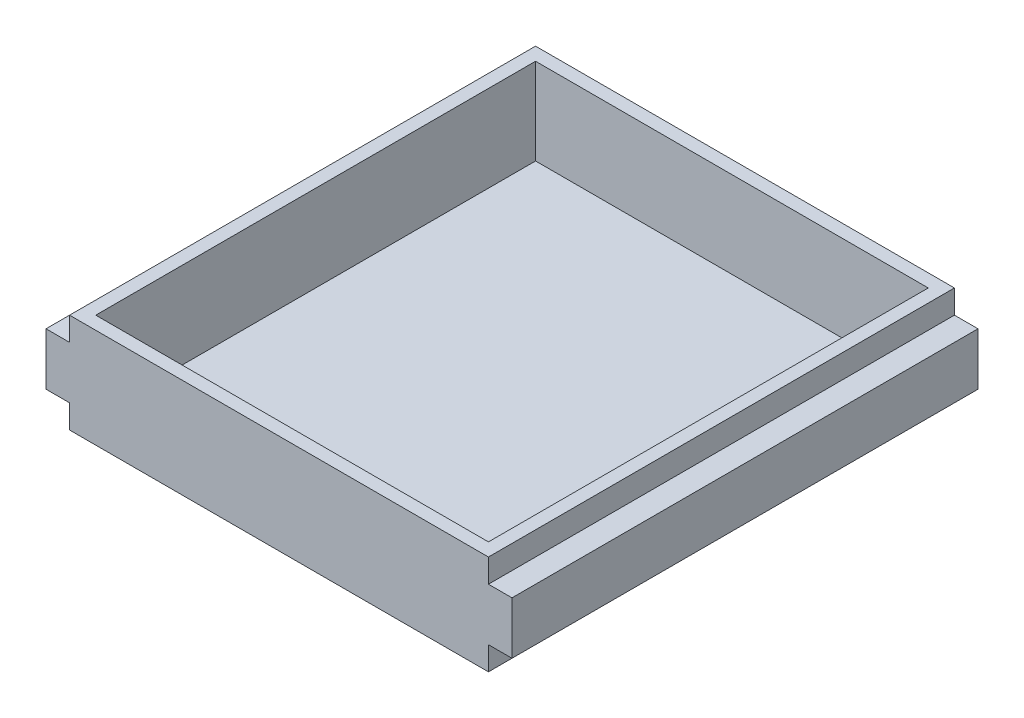
ISO-10303-21;
HEADER;
FILE_DESCRIPTION(('STEP AP214'),'2;1');
FILE_NAME('part.step','',(''),(''),'','','');
FILE_SCHEMA(('AUTOMOTIVE_DESIGN { 1 0 10303 214 1 1 1 1 }'));
ENDSEC;
DATA;
#1=APPLICATION_CONTEXT('core data for automotive mechanical design processes');
#2=APPLICATION_PROTOCOL_DEFINITION('international standard','automotive_design',2000,#1);
#3=PRODUCT_CONTEXT('',#1,'mechanical');
#4=PRODUCT('Part','Part','',(#3));
#5=PRODUCT_RELATED_PRODUCT_CATEGORY('part','',(#4));
#6=PRODUCT_DEFINITION_FORMATION('','',#4);
#7=PRODUCT_DEFINITION_CONTEXT('part definition',#1,'design');
#8=PRODUCT_DEFINITION('design','',#6,#7);
#9=PRODUCT_DEFINITION_SHAPE('','',#8);
#10=(LENGTH_UNIT() NAMED_UNIT(*) SI_UNIT(.MILLI.,.METRE.));
#11=(NAMED_UNIT(*) PLANE_ANGLE_UNIT() SI_UNIT($,.RADIAN.));
#12=(NAMED_UNIT(*) SI_UNIT($,.STERADIAN.) SOLID_ANGLE_UNIT());
#13=UNCERTAINTY_MEASURE_WITH_UNIT(LENGTH_MEASURE(1.E-05),#10,'distance_accuracy_value','');
#14=(GEOMETRIC_REPRESENTATION_CONTEXT(3) GLOBAL_UNCERTAINTY_ASSIGNED_CONTEXT((#13)) GLOBAL_UNIT_ASSIGNED_CONTEXT((#10,
#11,#12)) REPRESENTATION_CONTEXT('',''));
#15=CARTESIAN_POINT('',(0.,0.,0.));
#16=DIRECTION('',(0.,0.,1.));
#17=DIRECTION('',(1.,0.,0.));
#18=AXIS2_PLACEMENT_3D('',#15,#16,#17);
#19=CARTESIAN_POINT('',(169.,0.,-178.));
#20=DIRECTION('',(0.,-1.,0.));
#21=DIRECTION('',(1.,0.,0.));
#22=AXIS2_PLACEMENT_3D('',#19,#20,#21);
#23=PLANE('',#22);
#24=DIRECTION('',(1.,0.,0.));
#25=VECTOR('',#24,1.);
#26=CARTESIAN_POINT('',(169.,0.,0.));
#27=LINE('',#26,#25);
#28=CARTESIAN_POINT('',(169.,0.,0.));
#29=VERTEX_POINT('',#28);
#30=CARTESIAN_POINT('',(178.,0.,0.));
#31=VERTEX_POINT('',#30);
#32=EDGE_CURVE('E167',#29,#31,#27,.T.);
#33=ORIENTED_EDGE('',*,*,#32,.F.);
#34=DIRECTION('',(0.,0.,1.));
#35=VECTOR('',#34,1.);
#36=CARTESIAN_POINT('',(169.,0.,-178.));
#37=LINE('',#36,#35);
#38=CARTESIAN_POINT('',(169.,0.,-178.));
#39=VERTEX_POINT('',#38);
#40=EDGE_CURVE('E11',#39,#29,#37,.T.);
#41=ORIENTED_EDGE('',*,*,#40,.F.);
#42=DIRECTION('',(1.,0.,0.));
#43=VECTOR('',#42,1.);
#44=CARTESIAN_POINT('',(169.,0.,-178.));
#45=LINE('',#44,#43);
#46=CARTESIAN_POINT('',(178.,0.,-178.));
#47=VERTEX_POINT('',#46);
#48=EDGE_CURVE('E200',#39,#47,#45,.T.);
#49=ORIENTED_EDGE('',*,*,#48,.T.);
#50=DIRECTION('',(0.,0.,1.));
#51=VECTOR('',#50,1.);
#52=CARTESIAN_POINT('',(178.,0.,-178.));
#53=LINE('',#52,#51);
#54=EDGE_CURVE('E36',#47,#31,#53,.T.);
#55=ORIENTED_EDGE('',*,*,#54,.T.);
#56=EDGE_LOOP('',(#33,#41,#49,#55));
#57=FACE_BOUND('',#56,.T.);
#58=ADVANCED_FACE('F33',(#57),#23,.T.);
#59=CARTESIAN_POINT('',(169.,-8.99999999999997,-178.));
#60=DIRECTION('',(1.,0.,0.));
#61=DIRECTION('',(0.,0.,-1.));
#62=AXIS2_PLACEMENT_3D('',#59,#60,#61);
#63=PLANE('',#62);
#64=DIRECTION('',(0.,1.,0.));
#65=VECTOR('',#64,1.);
#66=CARTESIAN_POINT('',(169.,-8.99999999999997,0.));
#67=LINE('',#66,#65);
#68=CARTESIAN_POINT('',(169.,-8.99999999999997,0.));
#69=VERTEX_POINT('',#68);
#70=EDGE_CURVE('E198',#69,#29,#67,.T.);
#71=ORIENTED_EDGE('',*,*,#70,.F.);
#72=DIRECTION('',(0.,0.,1.));
#73=VECTOR('',#72,1.);
#74=CARTESIAN_POINT('',(169.,-8.99999999999997,-178.));
#75=LINE('',#74,#73);
#76=CARTESIAN_POINT('',(169.,-8.99999999999997,-178.));
#77=VERTEX_POINT('',#76);
#78=EDGE_CURVE('E41',#77,#69,#75,.T.);
#79=ORIENTED_EDGE('',*,*,#78,.F.);
#80=DIRECTION('',(0.,1.,0.));
#81=VECTOR('',#80,1.);
#82=CARTESIAN_POINT('',(169.,-8.99999999999997,-178.));
#83=LINE('',#82,#81);
#84=EDGE_CURVE('E157',#77,#39,#83,.T.);
#85=ORIENTED_EDGE('',*,*,#84,.T.);
#86=ORIENTED_EDGE('',*,*,#40,.T.);
#87=EDGE_LOOP('',(#71,#79,#85,#86));
#88=FACE_BOUND('',#87,.T.);
#89=ADVANCED_FACE('F220',(#88),#63,.T.);
#90=CARTESIAN_POINT('',(169.,-8.99999999999997,-178.));
#91=DIRECTION('',(0.,-1.,0.));
#92=DIRECTION('',(1.,0.,0.));
#93=AXIS2_PLACEMENT_3D('',#90,#91,#92);
#94=PLANE('',#93);
#95=DIRECTION('',(1.,0.,0.));
#96=VECTOR('',#95,1.);
#97=CARTESIAN_POINT('',(169.,-8.99999999999997,0.));
#98=LINE('',#97,#96);
#99=CARTESIAN_POINT('',(9.,-9.,0.));
#100=VERTEX_POINT('',#99);
#101=EDGE_CURVE('E144',#100,#69,#98,.T.);
#102=ORIENTED_EDGE('',*,*,#101,.F.);
#103=DIRECTION('',(0.,0.,1.));
#104=VECTOR('',#103,1.);
#105=CARTESIAN_POINT('',(9.,-9.,-178.));
#106=LINE('',#105,#104);
#107=CARTESIAN_POINT('',(9.,-9.,-178.));
#108=VERTEX_POINT('',#107);
#109=EDGE_CURVE('E138',#108,#100,#106,.T.);
#110=ORIENTED_EDGE('',*,*,#109,.F.);
#111=DIRECTION('',(1.,0.,0.));
#112=VECTOR('',#111,1.);
#113=CARTESIAN_POINT('',(169.,-8.99999999999997,-178.));
#114=LINE('',#113,#112);
#115=EDGE_CURVE('E141',#108,#77,#114,.T.);
#116=ORIENTED_EDGE('',*,*,#115,.T.);
#117=ORIENTED_EDGE('',*,*,#78,.T.);
#118=EDGE_LOOP('',(#102,#110,#116,#117));
#119=FACE_BOUND('',#118,.T.);
#120=ADVANCED_FACE('F140',(#119),#94,.T.);
#121=CARTESIAN_POINT('',(9.,-9.,-178.));
#122=DIRECTION('',(-1.,0.,0.));
#123=DIRECTION('',(0.,0.,1.));
#124=AXIS2_PLACEMENT_3D('',#121,#122,#123);
#125=PLANE('',#124);
#126=DIRECTION('',(0.,-1.,0.));
#127=VECTOR('',#126,1.);
#128=CARTESIAN_POINT('',(9.,-9.,0.));
#129=LINE('',#128,#127);
#130=CARTESIAN_POINT('',(9.,0.,0.));
#131=VERTEX_POINT('',#130);
#132=EDGE_CURVE('E195',#131,#100,#129,.T.);
#133=ORIENTED_EDGE('',*,*,#132,.F.);
#134=DIRECTION('',(0.,0.,1.));
#135=VECTOR('',#134,1.);
#136=CARTESIAN_POINT('',(9.,0.,-178.));
#137=LINE('',#136,#135);
#138=CARTESIAN_POINT('',(9.,0.,-178.));
#139=VERTEX_POINT('',#138);
#140=EDGE_CURVE('E149',#139,#131,#137,.T.);
#141=ORIENTED_EDGE('',*,*,#140,.F.);
#142=DIRECTION('',(0.,-1.,0.));
#143=VECTOR('',#142,1.);
#144=CARTESIAN_POINT('',(9.,-9.,-178.));
#145=LINE('',#144,#143);
#146=EDGE_CURVE('E155',#139,#108,#145,.T.);
#147=ORIENTED_EDGE('',*,*,#146,.T.);
#148=ORIENTED_EDGE('',*,*,#109,.T.);
#149=EDGE_LOOP('',(#133,#141,#147,#148));
#150=FACE_BOUND('',#149,.T.);
#151=ADVANCED_FACE('F159',(#150),#125,.T.);
#152=CARTESIAN_POINT('',(9.,0.,-178.));
#153=DIRECTION('',(0.,-1.,0.));
#154=DIRECTION('',(1.,0.,0.));
#155=AXIS2_PLACEMENT_3D('',#152,#153,#154);
#156=PLANE('',#155);
#157=DIRECTION('',(1.,0.,0.));
#158=VECTOR('',#157,1.);
#159=CARTESIAN_POINT('',(9.,0.,0.));
#160=LINE('',#159,#158);
#161=CARTESIAN_POINT('',(0.,0.,0.));
#162=VERTEX_POINT('',#161);
#163=EDGE_CURVE('E192',#162,#131,#160,.T.);
#164=ORIENTED_EDGE('',*,*,#163,.F.);
#165=DIRECTION('',(0.,0.,1.));
#166=VECTOR('',#165,1.);
#167=CARTESIAN_POINT('',(0.,0.,-178.));
#168=LINE('',#167,#166);
#169=CARTESIAN_POINT('',(0.,0.,-178.));
#170=VERTEX_POINT('',#169);
#171=EDGE_CURVE('E204',#170,#162,#168,.T.);
#172=ORIENTED_EDGE('',*,*,#171,.F.);
#173=DIRECTION('',(1.,0.,0.));
#174=VECTOR('',#173,1.);
#175=CARTESIAN_POINT('',(9.,0.,-178.));
#176=LINE('',#175,#174);
#177=EDGE_CURVE('E160',#170,#139,#176,.T.);
#178=ORIENTED_EDGE('',*,*,#177,.T.);
#179=ORIENTED_EDGE('',*,*,#140,.T.);
#180=EDGE_LOOP('',(#164,#172,#178,#179));
#181=FACE_BOUND('',#180,.T.);
#182=ADVANCED_FACE('F233',(#181),#156,.T.);
#183=CARTESIAN_POINT('',(0.,0.,-178.));
#184=DIRECTION('',(-1.,0.,0.));
#185=DIRECTION('',(0.,0.,1.));
#186=AXIS2_PLACEMENT_3D('',#183,#184,#185);
#187=PLANE('',#186);
#188=DIRECTION('',(0.,-1.,0.));
#189=VECTOR('',#188,1.);
#190=CARTESIAN_POINT('',(0.,0.,0.));
#191=LINE('',#190,#189);
#192=CARTESIAN_POINT('',(0.,20.,0.));
#193=VERTEX_POINT('',#192);
#194=EDGE_CURVE('E189',#193,#162,#191,.T.);
#195=ORIENTED_EDGE('',*,*,#194,.F.);
#196=DIRECTION('',(0.,0.,1.));
#197=VECTOR('',#196,1.);
#198=CARTESIAN_POINT('',(0.,20.,-178.));
#199=LINE('',#198,#197);
#200=CARTESIAN_POINT('',(0.,20.,-178.));
#201=VERTEX_POINT('',#200);
#202=EDGE_CURVE('E206',#201,#193,#199,.T.);
#203=ORIENTED_EDGE('',*,*,#202,.F.);
#204=DIRECTION('',(0.,-1.,0.));
#205=VECTOR('',#204,1.);
#206=CARTESIAN_POINT('',(0.,0.,-178.));
#207=LINE('',#206,#205);
#208=EDGE_CURVE('E162',#201,#170,#207,.T.);
#209=ORIENTED_EDGE('',*,*,#208,.T.);
#210=ORIENTED_EDGE('',*,*,#171,.T.);
#211=EDGE_LOOP('',(#195,#203,#209,#210));
#212=FACE_BOUND('',#211,.T.);
#213=ADVANCED_FACE('F236',(#212),#187,.T.);
#214=CARTESIAN_POINT('',(0.,20.,-178.));
#215=DIRECTION('',(0.,1.,0.));
#216=DIRECTION('',(0.,0.,1.));
#217=AXIS2_PLACEMENT_3D('',#214,#215,#216);
#218=PLANE('',#217);
#219=DIRECTION('',(-1.,0.,0.));
#220=VECTOR('',#219,1.);
#221=CARTESIAN_POINT('',(0.,20.,0.));
#222=LINE('',#221,#220);
#223=CARTESIAN_POINT('',(9.,20.,0.));
#224=VERTEX_POINT('',#223);
#225=EDGE_CURVE('E186',#224,#193,#222,.T.);
#226=ORIENTED_EDGE('',*,*,#225,.F.);
#227=DIRECTION('',(0.,0.,1.));
#228=VECTOR('',#227,1.);
#229=CARTESIAN_POINT('',(9.,20.,-178.));
#230=LINE('',#229,#228);
#231=CARTESIAN_POINT('',(9.,20.,-178.));
#232=VERTEX_POINT('',#231);
#233=EDGE_CURVE('E208',#232,#224,#230,.T.);
#234=ORIENTED_EDGE('',*,*,#233,.F.);
#235=DIRECTION('',(-1.,0.,0.));
#236=VECTOR('',#235,1.);
#237=CARTESIAN_POINT('',(0.,20.,-178.));
#238=LINE('',#237,#236);
#239=EDGE_CURVE('E341',#232,#201,#238,.T.);
#240=ORIENTED_EDGE('',*,*,#239,.T.);
#241=ORIENTED_EDGE('',*,*,#202,.T.);
#242=EDGE_LOOP('',(#226,#234,#240,#241));
#243=FACE_BOUND('',#242,.T.);
#244=ADVANCED_FACE('F240',(#243),#218,.T.);
#245=CARTESIAN_POINT('',(9.,20.,-178.));
#246=DIRECTION('',(-1.,0.,0.));
#247=DIRECTION('',(0.,0.,1.));
#248=AXIS2_PLACEMENT_3D('',#245,#246,#247);
#249=PLANE('',#248);
#250=DIRECTION('',(0.,-1.,0.));
#251=VECTOR('',#250,1.);
#252=CARTESIAN_POINT('',(9.,20.,0.));
#253=LINE('',#252,#251);
#254=CARTESIAN_POINT('',(9.,29.,0.));
#255=VERTEX_POINT('',#254);
#256=EDGE_CURVE('E183',#255,#224,#253,.T.);
#257=ORIENTED_EDGE('',*,*,#256,.F.);
#258=DIRECTION('',(0.,0.,1.));
#259=VECTOR('',#258,1.);
#260=CARTESIAN_POINT('',(9.,29.,-178.));
#261=LINE('',#260,#259);
#262=CARTESIAN_POINT('',(9.,29.,-178.));
#263=VERTEX_POINT('',#262);
#264=EDGE_CURVE('E210',#263,#255,#261,.T.);
#265=ORIENTED_EDGE('',*,*,#264,.F.);
#266=DIRECTION('',(0.,-1.,0.));
#267=VECTOR('',#266,1.);
#268=CARTESIAN_POINT('',(9.,20.,-178.));
#269=LINE('',#268,#267);
#270=EDGE_CURVE('E338',#263,#232,#269,.T.);
#271=ORIENTED_EDGE('',*,*,#270,.T.);
#272=ORIENTED_EDGE('',*,*,#233,.T.);
#273=EDGE_LOOP('',(#257,#265,#271,#272));
#274=FACE_BOUND('',#273,.T.);
#275=ADVANCED_FACE('F244',(#274),#249,.T.);
#276=CARTESIAN_POINT('',(9.,29.,-178.));
#277=DIRECTION('',(0.,1.,0.));
#278=DIRECTION('',(-1.,0.,0.));
#279=AXIS2_PLACEMENT_3D('',#276,#277,#278);
#280=PLANE('',#279);
#281=DIRECTION('',(0.,0.,-1.));
#282=VECTOR('',#281,1.);
#283=CARTESIAN_POINT('',(164.,29.,-173.));
#284=LINE('',#283,#282);
#285=CARTESIAN_POINT('',(164.,29.,-4.99999999999997));
#286=VERTEX_POINT('',#285);
#287=CARTESIAN_POINT('',(164.,29.,-173.));
#288=VERTEX_POINT('',#287);
#289=EDGE_CURVE('E49',#286,#288,#284,.T.);
#290=ORIENTED_EDGE('',*,*,#289,.F.);
#291=DIRECTION('',(1.,0.,0.));
#292=VECTOR('',#291,1.);
#293=CARTESIAN_POINT('',(164.,29.,-4.99999999999997));
#294=LINE('',#293,#292);
#295=CARTESIAN_POINT('',(14.,29.,-4.99999999999995));
#296=VERTEX_POINT('',#295);
#297=EDGE_CURVE('E301',#296,#286,#294,.T.);
#298=ORIENTED_EDGE('',*,*,#297,.F.);
#299=DIRECTION('',(0.,0.,1.));
#300=VECTOR('',#299,1.);
#301=CARTESIAN_POINT('',(14.,29.,-173.));
#302=LINE('',#301,#300);
#303=CARTESIAN_POINT('',(14.,29.,-173.));
#304=VERTEX_POINT('',#303);
#305=EDGE_CURVE('E306',#304,#296,#302,.T.);
#306=ORIENTED_EDGE('',*,*,#305,.F.);
#307=DIRECTION('',(-1.,0.,0.));
#308=VECTOR('',#307,1.);
#309=CARTESIAN_POINT('',(164.,29.,-173.));
#310=LINE('',#309,#308);
#311=EDGE_CURVE('E313',#288,#304,#310,.T.);
#312=ORIENTED_EDGE('',*,*,#311,.F.);
#313=EDGE_LOOP('',(#290,#298,#306,#312));
#314=FACE_BOUND('',#313,.T.);
#315=DIRECTION('',(-1.,0.,0.));
#316=VECTOR('',#315,1.);
#317=CARTESIAN_POINT('',(9.,29.,0.));
#318=LINE('',#317,#316);
#319=CARTESIAN_POINT('',(169.,29.,0.));
#320=VERTEX_POINT('',#319);
#321=EDGE_CURVE('E180',#320,#255,#318,.T.);
#322=ORIENTED_EDGE('',*,*,#321,.F.);
#323=DIRECTION('',(0.,0.,1.));
#324=VECTOR('',#323,1.);
#325=CARTESIAN_POINT('',(169.,29.,-178.));
#326=LINE('',#325,#324);
#327=CARTESIAN_POINT('',(169.,29.,-178.));
#328=VERTEX_POINT('',#327);
#329=EDGE_CURVE('E212',#328,#320,#326,.T.);
#330=ORIENTED_EDGE('',*,*,#329,.F.);
#331=DIRECTION('',(-1.,0.,0.));
#332=VECTOR('',#331,1.);
#333=CARTESIAN_POINT('',(9.,29.,-178.));
#334=LINE('',#333,#332);
#335=EDGE_CURVE('E335',#328,#263,#334,.T.);
#336=ORIENTED_EDGE('',*,*,#335,.T.);
#337=ORIENTED_EDGE('',*,*,#264,.T.);
#338=EDGE_LOOP('',(#322,#330,#336,#337));
#339=FACE_BOUND('',#338,.T.);
#340=ADVANCED_FACE('F248',(#314,#339),#280,.T.);
#341=CARTESIAN_POINT('',(169.,20.,-178.));
#342=DIRECTION('',(1.,0.,0.));
#343=DIRECTION('',(0.,0.,-1.));
#344=AXIS2_PLACEMENT_3D('',#341,#342,#343);
#345=PLANE('',#344);
#346=DIRECTION('',(0.,1.,0.));
#347=VECTOR('',#346,1.);
#348=CARTESIAN_POINT('',(169.,20.,0.));
#349=LINE('',#348,#347);
#350=CARTESIAN_POINT('',(169.,20.,0.));
#351=VERTEX_POINT('',#350);
#352=EDGE_CURVE('E177',#351,#320,#349,.T.);
#353=ORIENTED_EDGE('',*,*,#352,.F.);
#354=DIRECTION('',(0.,0.,1.));
#355=VECTOR('',#354,1.);
#356=CARTESIAN_POINT('',(169.,20.,-178.));
#357=LINE('',#356,#355);
#358=CARTESIAN_POINT('',(169.,20.,-178.));
#359=VERTEX_POINT('',#358);
#360=EDGE_CURVE('E214',#359,#351,#357,.T.);
#361=ORIENTED_EDGE('',*,*,#360,.F.);
#362=DIRECTION('',(0.,1.,0.));
#363=VECTOR('',#362,1.);
#364=CARTESIAN_POINT('',(169.,20.,-178.));
#365=LINE('',#364,#363);
#366=EDGE_CURVE('E332',#359,#328,#365,.T.);
#367=ORIENTED_EDGE('',*,*,#366,.T.);
#368=ORIENTED_EDGE('',*,*,#329,.T.);
#369=EDGE_LOOP('',(#353,#361,#367,#368));
#370=FACE_BOUND('',#369,.T.);
#371=ADVANCED_FACE('F252',(#370),#345,.T.);
#372=CARTESIAN_POINT('',(178.,20.,-178.));
#373=DIRECTION('',(0.,1.,0.));
#374=DIRECTION('',(0.,0.,1.));
#375=AXIS2_PLACEMENT_3D('',#372,#373,#374);
#376=PLANE('',#375);
#377=DIRECTION('',(-1.,0.,0.));
#378=VECTOR('',#377,1.);
#379=CARTESIAN_POINT('',(178.,20.,0.));
#380=LINE('',#379,#378);
#381=CARTESIAN_POINT('',(178.,20.,0.));
#382=VERTEX_POINT('',#381);
#383=EDGE_CURVE('E174',#382,#351,#380,.T.);
#384=ORIENTED_EDGE('',*,*,#383,.F.);
#385=DIRECTION('',(0.,0.,1.));
#386=VECTOR('',#385,1.);
#387=CARTESIAN_POINT('',(178.,20.,-178.));
#388=LINE('',#387,#386);
#389=CARTESIAN_POINT('',(178.,20.,-178.));
#390=VERTEX_POINT('',#389);
#391=EDGE_CURVE('E215',#390,#382,#388,.T.);
#392=ORIENTED_EDGE('',*,*,#391,.F.);
#393=DIRECTION('',(-1.,0.,0.));
#394=VECTOR('',#393,1.);
#395=CARTESIAN_POINT('',(178.,20.,-178.));
#396=LINE('',#395,#394);
#397=EDGE_CURVE('E329',#390,#359,#396,.T.);
#398=ORIENTED_EDGE('',*,*,#397,.T.);
#399=ORIENTED_EDGE('',*,*,#360,.T.);
#400=EDGE_LOOP('',(#384,#392,#398,#399));
#401=FACE_BOUND('',#400,.T.);
#402=ADVANCED_FACE('F256',(#401),#376,.T.);
#403=CARTESIAN_POINT('',(178.,0.,-178.));
#404=DIRECTION('',(1.,0.,0.));
#405=DIRECTION('',(0.,0.,-1.));
#406=AXIS2_PLACEMENT_3D('',#403,#404,#405);
#407=PLANE('',#406);
#408=DIRECTION('',(0.,1.,0.));
#409=VECTOR('',#408,1.);
#410=CARTESIAN_POINT('',(178.,0.,0.));
#411=LINE('',#410,#409);
#412=EDGE_CURVE('E170',#31,#382,#411,.T.);
#413=ORIENTED_EDGE('',*,*,#412,.F.);
#414=ORIENTED_EDGE('',*,*,#54,.F.);
#415=DIRECTION('',(0.,1.,0.));
#416=VECTOR('',#415,1.);
#417=CARTESIAN_POINT('',(178.,0.,-178.));
#418=LINE('',#417,#416);
#419=EDGE_CURVE('E327',#47,#390,#418,.T.);
#420=ORIENTED_EDGE('',*,*,#419,.T.);
#421=ORIENTED_EDGE('',*,*,#391,.T.);
#422=EDGE_LOOP('',(#413,#414,#420,#421));
#423=FACE_BOUND('',#422,.T.);
#424=ADVANCED_FACE('F217',(#423),#407,.T.);
#425=CARTESIAN_POINT('',(0.,0.,-178.));
#426=DIRECTION('',(0.,0.,1.));
#427=DIRECTION('',(1.,0.,0.));
#428=AXIS2_PLACEMENT_3D('',#425,#426,#427);
#429=PLANE('',#428);
#430=ORIENTED_EDGE('',*,*,#48,.F.);
#431=ORIENTED_EDGE('',*,*,#84,.F.);
#432=ORIENTED_EDGE('',*,*,#115,.F.);
#433=ORIENTED_EDGE('',*,*,#146,.F.);
#434=ORIENTED_EDGE('',*,*,#177,.F.);
#435=ORIENTED_EDGE('',*,*,#208,.F.);
#436=ORIENTED_EDGE('',*,*,#239,.F.);
#437=ORIENTED_EDGE('',*,*,#270,.F.);
#438=ORIENTED_EDGE('',*,*,#335,.F.);
#439=ORIENTED_EDGE('',*,*,#366,.F.);
#440=ORIENTED_EDGE('',*,*,#397,.F.);
#441=ORIENTED_EDGE('',*,*,#419,.F.);
#442=EDGE_LOOP('',(#430,#431,#432,#433,#434,#435,#436,#437,#438,#439,#440,#441));
#443=FACE_BOUND('',#442,.T.);
#444=ADVANCED_FACE('F153',(#443),#429,.F.);
#445=CARTESIAN_POINT('',(0.,0.,0.));
#446=DIRECTION('',(0.,0.,1.));
#447=DIRECTION('',(1.,0.,0.));
#448=AXIS2_PLACEMENT_3D('',#445,#446,#447);
#449=PLANE('',#448);
#450=ORIENTED_EDGE('',*,*,#32,.T.);
#451=ORIENTED_EDGE('',*,*,#412,.T.);
#452=ORIENTED_EDGE('',*,*,#383,.T.);
#453=ORIENTED_EDGE('',*,*,#352,.T.);
#454=ORIENTED_EDGE('',*,*,#321,.T.);
#455=ORIENTED_EDGE('',*,*,#256,.T.);
#456=ORIENTED_EDGE('',*,*,#225,.T.);
#457=ORIENTED_EDGE('',*,*,#194,.T.);
#458=ORIENTED_EDGE('',*,*,#163,.T.);
#459=ORIENTED_EDGE('',*,*,#132,.T.);
#460=ORIENTED_EDGE('',*,*,#101,.T.);
#461=ORIENTED_EDGE('',*,*,#70,.T.);
#462=EDGE_LOOP('',(#450,#451,#452,#453,#454,#455,#456,#457,#458,#459,#460,#461));
#463=FACE_BOUND('',#462,.T.);
#464=ADVANCED_FACE('F219',(#463),#449,.T.);
#465=CARTESIAN_POINT('',(164.,-3.99999999999998,-173.));
#466=DIRECTION('',(1.,0.,0.));
#467=DIRECTION('',(0.,1.,0.));
#468=AXIS2_PLACEMENT_3D('',#465,#466,#467);
#469=PLANE('',#468);
#470=ORIENTED_EDGE('',*,*,#289,.T.);
#471=DIRECTION('',(0.,1.,0.));
#472=VECTOR('',#471,1.);
#473=CARTESIAN_POINT('',(164.,-3.99999999999998,-173.));
#474=LINE('',#473,#472);
#475=CARTESIAN_POINT('',(164.,-3.99999999999998,-173.));
#476=VERTEX_POINT('',#475);
#477=EDGE_CURVE('E311',#476,#288,#474,.T.);
#478=ORIENTED_EDGE('',*,*,#477,.F.);
#479=DIRECTION('',(0.,0.,-1.));
#480=VECTOR('',#479,1.);
#481=CARTESIAN_POINT('',(164.,-3.99999999999998,-173.));
#482=LINE('',#481,#480);
#483=CARTESIAN_POINT('',(164.,-3.99999999999998,-4.99999999999997));
#484=VERTEX_POINT('',#483);
#485=EDGE_CURVE('E293',#484,#476,#482,.T.);
#486=ORIENTED_EDGE('',*,*,#485,.F.);
#487=DIRECTION('',(0.,1.,0.));
#488=VECTOR('',#487,1.);
#489=CARTESIAN_POINT('',(164.,-3.99999999999998,-4.99999999999997));
#490=LINE('',#489,#488);
#491=EDGE_CURVE('E171',#484,#286,#490,.T.);
#492=ORIENTED_EDGE('',*,*,#491,.T.);
#493=EDGE_LOOP('',(#470,#478,#486,#492));
#494=FACE_BOUND('',#493,.T.);
#495=ADVANCED_FACE('F267',(#494),#469,.F.);
#496=CARTESIAN_POINT('',(164.,-3.99999999999998,-4.99999999999997));
#497=DIRECTION('',(0.,0.,1.));
#498=DIRECTION('',(1.,0.,0.));
#499=AXIS2_PLACEMENT_3D('',#496,#497,#498);
#500=PLANE('',#499);
#501=ORIENTED_EDGE('',*,*,#297,.T.);
#502=ORIENTED_EDGE('',*,*,#491,.F.);
#503=DIRECTION('',(1.,0.,0.));
#504=VECTOR('',#503,1.);
#505=CARTESIAN_POINT('',(164.,-3.99999999999998,-4.99999999999997));
#506=LINE('',#505,#504);
#507=CARTESIAN_POINT('',(14.,-4.,-4.99999999999995));
#508=VERTEX_POINT('',#507);
#509=EDGE_CURVE('E299',#508,#484,#506,.T.);
#510=ORIENTED_EDGE('',*,*,#509,.F.);
#511=DIRECTION('',(0.,1.,0.));
#512=VECTOR('',#511,1.);
#513=CARTESIAN_POINT('',(14.,-4.,-4.99999999999995));
#514=LINE('',#513,#512);
#515=EDGE_CURVE('E319',#508,#296,#514,.T.);
#516=ORIENTED_EDGE('',*,*,#515,.T.);
#517=EDGE_LOOP('',(#501,#502,#510,#516));
#518=FACE_BOUND('',#517,.T.);
#519=ADVANCED_FACE('F271',(#518),#500,.F.);
#520=CARTESIAN_POINT('',(14.,-4.,-173.));
#521=DIRECTION('',(-1.,0.,0.));
#522=DIRECTION('',(0.,-1.,0.));
#523=AXIS2_PLACEMENT_3D('',#520,#521,#522);
#524=PLANE('',#523);
#525=ORIENTED_EDGE('',*,*,#305,.T.);
#526=ORIENTED_EDGE('',*,*,#515,.F.);
#527=DIRECTION('',(0.,0.,1.));
#528=VECTOR('',#527,1.);
#529=CARTESIAN_POINT('',(14.,-4.,-173.));
#530=LINE('',#529,#528);
#531=CARTESIAN_POINT('',(14.,-4.,-173.));
#532=VERTEX_POINT('',#531);
#533=EDGE_CURVE('E303',#532,#508,#530,.T.);
#534=ORIENTED_EDGE('',*,*,#533,.F.);
#535=DIRECTION('',(0.,1.,0.));
#536=VECTOR('',#535,1.);
#537=CARTESIAN_POINT('',(14.,-4.,-173.));
#538=LINE('',#537,#536);
#539=EDGE_CURVE('E322',#532,#304,#538,.T.);
#540=ORIENTED_EDGE('',*,*,#539,.T.);
#541=EDGE_LOOP('',(#525,#526,#534,#540));
#542=FACE_BOUND('',#541,.T.);
#543=ADVANCED_FACE('F276',(#542),#524,.F.);
#544=CARTESIAN_POINT('',(164.,-3.99999999999998,-173.));
#545=DIRECTION('',(0.,0.,-1.));
#546=DIRECTION('',(-1.,0.,0.));
#547=AXIS2_PLACEMENT_3D('',#544,#545,#546);
#548=PLANE('',#547);
#549=ORIENTED_EDGE('',*,*,#311,.T.);
#550=ORIENTED_EDGE('',*,*,#539,.F.);
#551=DIRECTION('',(-1.,0.,0.));
#552=VECTOR('',#551,1.);
#553=CARTESIAN_POINT('',(164.,-3.99999999999998,-173.));
#554=LINE('',#553,#552);
#555=EDGE_CURVE('E297',#476,#532,#554,.T.);
#556=ORIENTED_EDGE('',*,*,#555,.F.);
#557=ORIENTED_EDGE('',*,*,#477,.T.);
#558=EDGE_LOOP('',(#549,#550,#556,#557));
#559=FACE_BOUND('',#558,.T.);
#560=ADVANCED_FACE('F272',(#559),#548,.F.);
#561=CARTESIAN_POINT('',(0.,-4.,0.));
#562=DIRECTION('',(0.,-1.,0.));
#563=DIRECTION('',(1.,0.,0.));
#564=AXIS2_PLACEMENT_3D('',#561,#562,#563);
#565=PLANE('',#564);
#566=ORIENTED_EDGE('',*,*,#485,.T.);
#567=ORIENTED_EDGE('',*,*,#555,.T.);
#568=ORIENTED_EDGE('',*,*,#533,.T.);
#569=ORIENTED_EDGE('',*,*,#509,.T.);
#570=EDGE_LOOP('',(#566,#567,#568,#569));
#571=FACE_BOUND('',#570,.T.);
#572=ADVANCED_FACE('F275',(#571),#565,.F.);
#573=CLOSED_SHELL('',(#58,#89,#120,#151,#182,#213,#244,#275,#340,#371,#402,#424,#444,#464,#495,
#519,#543,#560,#572));
#574=MANIFOLD_SOLID_BREP('B2',#573);
#575=ADVANCED_BREP_SHAPE_REPRESENTATION('',(#18,#574),#14);
#576=SHAPE_DEFINITION_REPRESENTATION(#9,#575);
ENDSEC;
END-ISO-10303-21;
